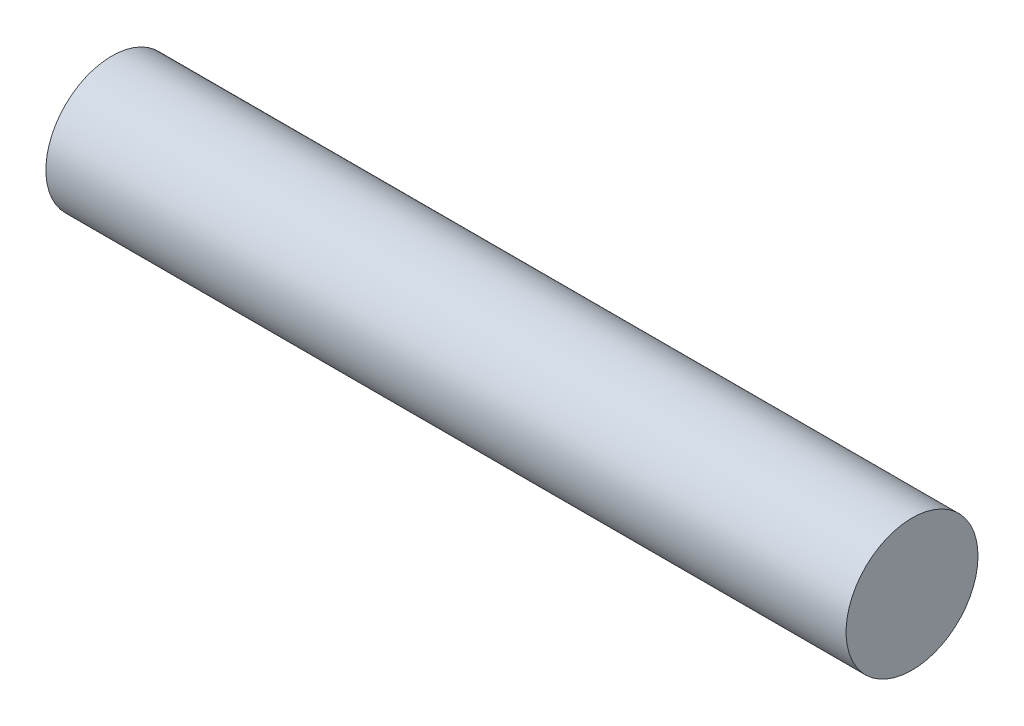
ISO-10303-21;
HEADER;
FILE_DESCRIPTION(('STEP AP214'),'2;1');
FILE_NAME('part.step','',(''),(''),'','','');
FILE_SCHEMA(('AUTOMOTIVE_DESIGN { 1 0 10303 214 1 1 1 1 }'));
ENDSEC;
DATA;
#1=APPLICATION_CONTEXT('core data for automotive mechanical design processes');
#2=APPLICATION_PROTOCOL_DEFINITION('international standard','automotive_design',2000,#1);
#3=PRODUCT_CONTEXT('',#1,'mechanical');
#4=PRODUCT('Part','Part','',(#3));
#5=PRODUCT_RELATED_PRODUCT_CATEGORY('part','',(#4));
#6=PRODUCT_DEFINITION_FORMATION('','',#4);
#7=PRODUCT_DEFINITION_CONTEXT('part definition',#1,'design');
#8=PRODUCT_DEFINITION('design','',#6,#7);
#9=PRODUCT_DEFINITION_SHAPE('','',#8);
#10=(LENGTH_UNIT() NAMED_UNIT(*) SI_UNIT(.MILLI.,.METRE.));
#11=(NAMED_UNIT(*) PLANE_ANGLE_UNIT() SI_UNIT($,.RADIAN.));
#12=(NAMED_UNIT(*) SI_UNIT($,.STERADIAN.) SOLID_ANGLE_UNIT());
#13=UNCERTAINTY_MEASURE_WITH_UNIT(LENGTH_MEASURE(1.E-05),#10,'distance_accuracy_value','');
#14=(GEOMETRIC_REPRESENTATION_CONTEXT(3) GLOBAL_UNCERTAINTY_ASSIGNED_CONTEXT((#13)) GLOBAL_UNIT_ASSIGNED_CONTEXT((#10,
#11,#12)) REPRESENTATION_CONTEXT('',''));
#15=CARTESIAN_POINT('',(0.,0.,0.));
#16=DIRECTION('',(0.,0.,1.));
#17=DIRECTION('',(1.,0.,0.));
#18=AXIS2_PLACEMENT_3D('',#15,#16,#17);
#19=CARTESIAN_POINT('',(-9.09921875,0.,43.));
#20=DIRECTION('',(1.,0.,0.));
#21=DIRECTION('',(0.,0.,-1.));
#22=AXIS2_PLACEMENT_3D('',#19,#20,#21);
#23=CYLINDRICAL_SURFACE('',#22,1.5);
#24=CARTESIAN_POINT('',(-9.09921875,0.,43.));
#25=DIRECTION('',(1.,0.,0.));
#26=DIRECTION('',(0.,0.,-1.));
#27=AXIS2_PLACEMENT_3D('',#24,#25,#26);
#28=CIRCLE('',#27,1.5);
#29=CARTESIAN_POINT('',(-9.09921875,0.,41.5));
#30=VERTEX_POINT('',#29);
#31=EDGE_CURVE('E10',#30,#30,#28,.T.);
#32=ORIENTED_EDGE('',*,*,#31,.T.);
#33=EDGE_LOOP('',(#32));
#34=FACE_BOUND('',#33,.T.);
#35=CARTESIAN_POINT('',(9.09921875,0.,43.));
#36=DIRECTION('',(1.,0.,0.));
#37=DIRECTION('',(0.,0.,-1.));
#38=AXIS2_PLACEMENT_3D('',#35,#36,#37);
#39=CIRCLE('',#38,1.5);
#40=CARTESIAN_POINT('',(9.09921875,0.,41.5));
#41=VERTEX_POINT('',#40);
#42=EDGE_CURVE('E40',#41,#41,#39,.T.);
#43=ORIENTED_EDGE('',*,*,#42,.F.);
#44=EDGE_LOOP('',(#43));
#45=FACE_BOUND('',#44,.T.);
#46=ADVANCED_FACE('F37',(#34,#45),#23,.T.);
#47=CARTESIAN_POINT('',(-9.09921875,0.,43.));
#48=DIRECTION('',(1.,0.,0.));
#49=DIRECTION('',(0.,0.,-1.));
#50=AXIS2_PLACEMENT_3D('',#47,#48,#49);
#51=PLANE('',#50);
#52=ORIENTED_EDGE('',*,*,#31,.F.);
#53=EDGE_LOOP('',(#52));
#54=FACE_BOUND('',#53,.T.);
#55=ADVANCED_FACE('F52',(#54),#51,.F.);
#56=CARTESIAN_POINT('',(9.09921875,0.,43.));
#57=DIRECTION('',(1.,0.,0.));
#58=DIRECTION('',(0.,0.,-1.));
#59=AXIS2_PLACEMENT_3D('',#56,#57,#58);
#60=PLANE('',#59);
#61=ORIENTED_EDGE('',*,*,#42,.T.);
#62=EDGE_LOOP('',(#61));
#63=FACE_BOUND('',#62,.T.);
#64=ADVANCED_FACE('F49',(#63),#60,.T.);
#65=CLOSED_SHELL('',(#46,#55,#64));
#66=MANIFOLD_SOLID_BREP('B2',#65);
#67=ADVANCED_BREP_SHAPE_REPRESENTATION('',(#18,#66),#14);
#68=SHAPE_DEFINITION_REPRESENTATION(#9,#67);
ENDSEC;
END-ISO-10303-21;
